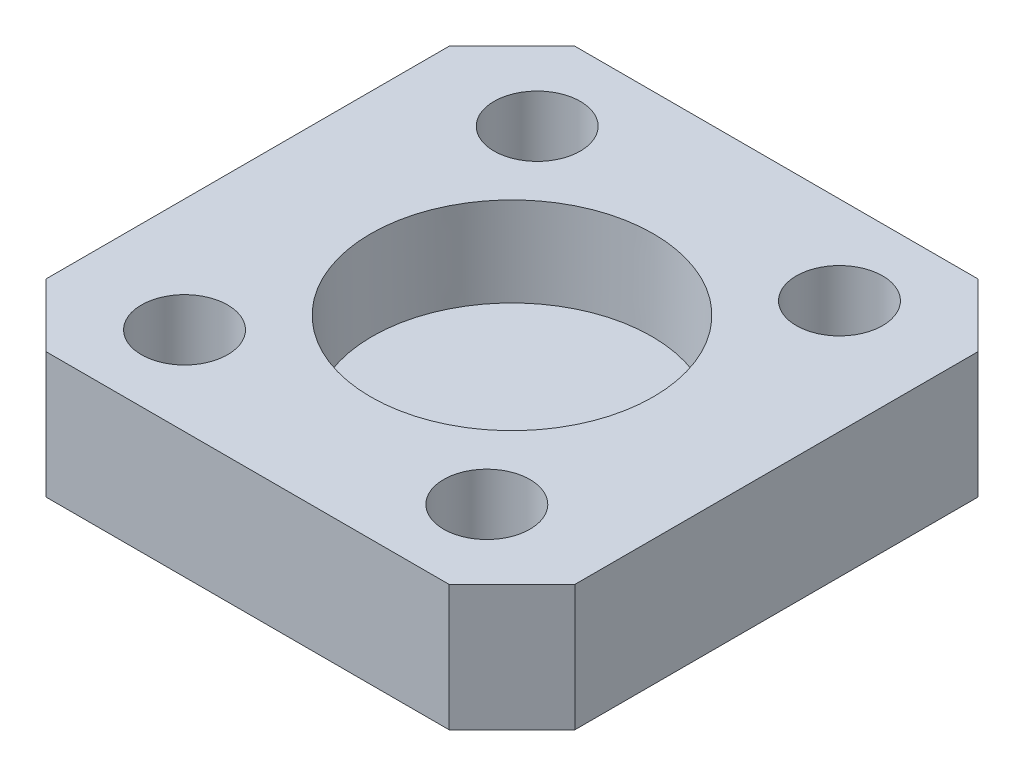
ISO-10303-21;
HEADER;
FILE_DESCRIPTION(('STEP AP214'),'2;1');
FILE_NAME('part.step','',(''),(''),'','','');
FILE_SCHEMA(('AUTOMOTIVE_DESIGN { 1 0 10303 214 1 1 1 1 }'));
ENDSEC;
DATA;
#1=APPLICATION_CONTEXT('core data for automotive mechanical design processes');
#2=APPLICATION_PROTOCOL_DEFINITION('international standard','automotive_design',2000,#1);
#3=PRODUCT_CONTEXT('',#1,'mechanical');
#4=PRODUCT('Part','Part','',(#3));
#5=PRODUCT_RELATED_PRODUCT_CATEGORY('part','',(#4));
#6=PRODUCT_DEFINITION_FORMATION('','',#4);
#7=PRODUCT_DEFINITION_CONTEXT('part definition',#1,'design');
#8=PRODUCT_DEFINITION('design','',#6,#7);
#9=PRODUCT_DEFINITION_SHAPE('','',#8);
#10=(LENGTH_UNIT() NAMED_UNIT(*) SI_UNIT(.MILLI.,.METRE.));
#11=(NAMED_UNIT(*) PLANE_ANGLE_UNIT() SI_UNIT($,.RADIAN.));
#12=(NAMED_UNIT(*) SI_UNIT($,.STERADIAN.) SOLID_ANGLE_UNIT());
#13=UNCERTAINTY_MEASURE_WITH_UNIT(LENGTH_MEASURE(1.E-05),#10,'distance_accuracy_value','');
#14=(GEOMETRIC_REPRESENTATION_CONTEXT(3) GLOBAL_UNCERTAINTY_ASSIGNED_CONTEXT((#13)) GLOBAL_UNIT_ASSIGNED_CONTEXT((#10,
#11,#12)) REPRESENTATION_CONTEXT('',''));
#15=CARTESIAN_POINT('',(0.,0.,0.));
#16=DIRECTION('',(0.,0.,1.));
#17=DIRECTION('',(1.,0.,0.));
#18=AXIS2_PLACEMENT_3D('',#15,#16,#17);
#19=CARTESIAN_POINT('',(21.,10.,21.));
#20=DIRECTION('',(-1.,0.,0.));
#21=DIRECTION('',(0.,0.,1.));
#22=AXIS2_PLACEMENT_3D('',#19,#20,#21);
#23=PLANE('',#22);
#24=DIRECTION('',(0.,0.,-1.));
#25=VECTOR('',#24,1.);
#26=CARTESIAN_POINT('',(21.,10.,21.));
#27=LINE('',#26,#25);
#28=CARTESIAN_POINT('',(21.,10.,16.));
#29=VERTEX_POINT('',#28);
#30=CARTESIAN_POINT('',(21.,10.,-16.));
#31=VERTEX_POINT('',#30);
#32=EDGE_CURVE('E129',#29,#31,#27,.T.);
#33=ORIENTED_EDGE('',*,*,#32,.F.);
#34=DIRECTION('',(0.,-1.,0.));
#35=VECTOR('',#34,1.);
#36=CARTESIAN_POINT('',(21.,10.,16.));
#37=LINE('',#36,#35);
#38=CARTESIAN_POINT('',(21.,0.,16.));
#39=VERTEX_POINT('',#38);
#40=EDGE_CURVE('E158',#29,#39,#37,.T.);
#41=ORIENTED_EDGE('',*,*,#40,.T.);
#42=DIRECTION('',(0.,0.,-1.));
#43=VECTOR('',#42,1.);
#44=CARTESIAN_POINT('',(21.,0.,21.));
#45=LINE('',#44,#43);
#46=CARTESIAN_POINT('',(21.,0.,-16.));
#47=VERTEX_POINT('',#46);
#48=EDGE_CURVE('E164',#39,#47,#45,.T.);
#49=ORIENTED_EDGE('',*,*,#48,.T.);
#50=DIRECTION('',(0.,1.,0.));
#51=VECTOR('',#50,1.);
#52=CARTESIAN_POINT('',(21.,10.,-16.));
#53=LINE('',#52,#51);
#54=EDGE_CURVE('E156',#47,#31,#53,.T.);
#55=ORIENTED_EDGE('',*,*,#54,.T.);
#56=EDGE_LOOP('',(#33,#41,#49,#55));
#57=FACE_BOUND('',#56,.T.);
#58=ADVANCED_FACE('F36',(#57),#23,.F.);
#59=CARTESIAN_POINT('',(-21.,10.,-21.));
#60=DIRECTION('',(0.,0.,1.));
#61=DIRECTION('',(1.,0.,0.));
#62=AXIS2_PLACEMENT_3D('',#59,#60,#61);
#63=PLANE('',#62);
#64=DIRECTION('',(-1.,0.,0.));
#65=VECTOR('',#64,1.);
#66=CARTESIAN_POINT('',(-21.,10.,-21.));
#67=LINE('',#66,#65);
#68=CARTESIAN_POINT('',(16.,10.,-21.));
#69=VERTEX_POINT('',#68);
#70=CARTESIAN_POINT('',(-16.,10.,-21.));
#71=VERTEX_POINT('',#70);
#72=EDGE_CURVE('E132',#69,#71,#67,.T.);
#73=ORIENTED_EDGE('',*,*,#72,.F.);
#74=DIRECTION('',(0.,-1.,0.));
#75=VECTOR('',#74,1.);
#76=CARTESIAN_POINT('',(16.,10.,-21.));
#77=LINE('',#76,#75);
#78=CARTESIAN_POINT('',(16.,0.,-21.));
#79=VERTEX_POINT('',#78);
#80=EDGE_CURVE('E11',#69,#79,#77,.T.);
#81=ORIENTED_EDGE('',*,*,#80,.T.);
#82=DIRECTION('',(-1.,0.,0.));
#83=VECTOR('',#82,1.);
#84=CARTESIAN_POINT('',(-21.,0.,-21.));
#85=LINE('',#84,#83);
#86=CARTESIAN_POINT('',(-16.,0.,-21.));
#87=VERTEX_POINT('',#86);
#88=EDGE_CURVE('E134',#79,#87,#85,.T.);
#89=ORIENTED_EDGE('',*,*,#88,.T.);
#90=DIRECTION('',(0.,1.,0.));
#91=VECTOR('',#90,1.);
#92=CARTESIAN_POINT('',(-16.,10.,-21.));
#93=LINE('',#92,#91);
#94=EDGE_CURVE('E45',#87,#71,#93,.T.);
#95=ORIENTED_EDGE('',*,*,#94,.T.);
#96=EDGE_LOOP('',(#73,#81,#89,#95));
#97=FACE_BOUND('',#96,.T.);
#98=ADVANCED_FACE('F260',(#97),#63,.F.);
#99=CARTESIAN_POINT('',(-21.,10.,21.));
#100=DIRECTION('',(1.,0.,0.));
#101=DIRECTION('',(0.,0.,-1.));
#102=AXIS2_PLACEMENT_3D('',#99,#100,#101);
#103=PLANE('',#102);
#104=DIRECTION('',(0.,0.,1.));
#105=VECTOR('',#104,1.);
#106=CARTESIAN_POINT('',(-21.,0.,21.));
#107=LINE('',#106,#105);
#108=CARTESIAN_POINT('',(-21.,0.,-16.));
#109=VERTEX_POINT('',#108);
#110=CARTESIAN_POINT('',(-21.,0.,16.));
#111=VERTEX_POINT('',#110);
#112=EDGE_CURVE('E130',#109,#111,#107,.T.);
#113=ORIENTED_EDGE('',*,*,#112,.T.);
#114=DIRECTION('',(0.,1.,0.));
#115=VECTOR('',#114,1.);
#116=CARTESIAN_POINT('',(-21.,10.,16.));
#117=LINE('',#116,#115);
#118=CARTESIAN_POINT('',(-21.,10.,16.));
#119=VERTEX_POINT('',#118);
#120=EDGE_CURVE('E108',#111,#119,#117,.T.);
#121=ORIENTED_EDGE('',*,*,#120,.T.);
#122=DIRECTION('',(0.,0.,1.));
#123=VECTOR('',#122,1.);
#124=CARTESIAN_POINT('',(-21.,10.,21.));
#125=LINE('',#124,#123);
#126=CARTESIAN_POINT('',(-21.,10.,-16.));
#127=VERTEX_POINT('',#126);
#128=EDGE_CURVE('E176',#127,#119,#125,.T.);
#129=ORIENTED_EDGE('',*,*,#128,.F.);
#130=DIRECTION('',(0.,-1.,0.));
#131=VECTOR('',#130,1.);
#132=CARTESIAN_POINT('',(-21.,10.,-16.));
#133=LINE('',#132,#131);
#134=EDGE_CURVE('E113',#127,#109,#133,.T.);
#135=ORIENTED_EDGE('',*,*,#134,.T.);
#136=EDGE_LOOP('',(#113,#121,#129,#135));
#137=FACE_BOUND('',#136,.T.);
#138=ADVANCED_FACE('F258',(#137),#103,.F.);
#139=CARTESIAN_POINT('',(-21.,10.,21.));
#140=DIRECTION('',(0.,0.,-1.));
#141=DIRECTION('',(-1.,0.,0.));
#142=AXIS2_PLACEMENT_3D('',#139,#140,#141);
#143=PLANE('',#142);
#144=DIRECTION('',(1.,0.,0.));
#145=VECTOR('',#144,1.);
#146=CARTESIAN_POINT('',(-21.,10.,21.));
#147=LINE('',#146,#145);
#148=CARTESIAN_POINT('',(-16.,10.,21.));
#149=VERTEX_POINT('',#148);
#150=CARTESIAN_POINT('',(16.,10.,21.));
#151=VERTEX_POINT('',#150);
#152=EDGE_CURVE('E123',#149,#151,#147,.T.);
#153=ORIENTED_EDGE('',*,*,#152,.F.);
#154=DIRECTION('',(0.,-1.,0.));
#155=VECTOR('',#154,1.);
#156=CARTESIAN_POINT('',(-16.,10.,21.));
#157=LINE('',#156,#155);
#158=CARTESIAN_POINT('',(-16.,0.,21.));
#159=VERTEX_POINT('',#158);
#160=EDGE_CURVE('E107',#149,#159,#157,.T.);
#161=ORIENTED_EDGE('',*,*,#160,.T.);
#162=DIRECTION('',(1.,0.,0.));
#163=VECTOR('',#162,1.);
#164=CARTESIAN_POINT('',(-21.,0.,21.));
#165=LINE('',#164,#163);
#166=CARTESIAN_POINT('',(16.,0.,21.));
#167=VERTEX_POINT('',#166);
#168=EDGE_CURVE('E120',#159,#167,#165,.T.);
#169=ORIENTED_EDGE('',*,*,#168,.T.);
#170=DIRECTION('',(0.,1.,0.));
#171=VECTOR('',#170,1.);
#172=CARTESIAN_POINT('',(16.,10.,21.));
#173=LINE('',#172,#171);
#174=EDGE_CURVE('E125',#167,#151,#173,.T.);
#175=ORIENTED_EDGE('',*,*,#174,.T.);
#176=EDGE_LOOP('',(#153,#161,#169,#175));
#177=FACE_BOUND('',#176,.T.);
#178=ADVANCED_FACE('F119',(#177),#143,.F.);
#179=CARTESIAN_POINT('',(0.,10.,0.));
#180=DIRECTION('',(0.,-1.,0.));
#181=DIRECTION('',(0.,0.,-1.));
#182=AXIS2_PLACEMENT_3D('',#179,#180,#181);
#183=PLANE('',#182);
#184=CARTESIAN_POINT('',(12.,10.,-14.));
#185=DIRECTION('',(0.,1.,0.));
#186=DIRECTION('',(0.,0.,-1.));
#187=AXIS2_PLACEMENT_3D('',#184,#185,#186);
#188=CIRCLE('',#187,3.425);
#189=CARTESIAN_POINT('',(12.,10.,-17.425));
#190=VERTEX_POINT('',#189);
#191=EDGE_CURVE('E186',#190,#190,#188,.T.);
#192=ORIENTED_EDGE('',*,*,#191,.F.);
#193=EDGE_LOOP('',(#192));
#194=FACE_BOUND('',#193,.T.);
#195=CARTESIAN_POINT('',(12.,10.,14.));
#196=DIRECTION('',(0.,1.,0.));
#197=DIRECTION('',(0.,0.,1.));
#198=AXIS2_PLACEMENT_3D('',#195,#196,#197);
#199=CIRCLE('',#198,3.42499999999999);
#200=CARTESIAN_POINT('',(12.,10.,17.425));
#201=VERTEX_POINT('',#200);
#202=EDGE_CURVE('E193',#201,#201,#199,.T.);
#203=ORIENTED_EDGE('',*,*,#202,.F.);
#204=EDGE_LOOP('',(#203));
#205=FACE_BOUND('',#204,.T.);
#206=CARTESIAN_POINT('',(-12.,10.,14.));
#207=DIRECTION('',(0.,1.,0.));
#208=DIRECTION('',(0.,0.,-1.));
#209=AXIS2_PLACEMENT_3D('',#206,#207,#208);
#210=CIRCLE('',#209,3.425);
#211=CARTESIAN_POINT('',(-12.,10.,10.575));
#212=VERTEX_POINT('',#211);
#213=EDGE_CURVE('E199',#212,#212,#210,.T.);
#214=ORIENTED_EDGE('',*,*,#213,.F.);
#215=EDGE_LOOP('',(#214));
#216=FACE_BOUND('',#215,.T.);
#217=CARTESIAN_POINT('',(-12.,10.,-14.));
#218=DIRECTION('',(0.,1.,0.));
#219=DIRECTION('',(0.,0.,1.));
#220=AXIS2_PLACEMENT_3D('',#217,#218,#219);
#221=CIRCLE('',#220,3.425);
#222=CARTESIAN_POINT('',(-12.,10.,-10.575));
#223=VERTEX_POINT('',#222);
#224=EDGE_CURVE('E180',#223,#223,#221,.T.);
#225=ORIENTED_EDGE('',*,*,#224,.F.);
#226=EDGE_LOOP('',(#225));
#227=FACE_BOUND('',#226,.T.);
#228=CARTESIAN_POINT('',(0.,10.,0.));
#229=DIRECTION('',(0.,-1.,0.));
#230=DIRECTION('',(0.,0.,-1.));
#231=AXIS2_PLACEMENT_3D('',#228,#229,#230);
#232=CIRCLE('',#231,11.2221854544974);
#233=CARTESIAN_POINT('',(0.,10.,-11.2221854544974));
#234=VERTEX_POINT('',#233);
#235=EDGE_CURVE('E138',#234,#234,#232,.T.);
#236=ORIENTED_EDGE('',*,*,#235,.T.);
#237=EDGE_LOOP('',(#236));
#238=FACE_BOUND('',#237,.T.);
#239=ORIENTED_EDGE('',*,*,#128,.T.);
#240=DIRECTION('',(-0.707106781186546,0.,-0.707106781186549));
#241=VECTOR('',#240,1.);
#242=CARTESIAN_POINT('',(-16.,10.,21.));
#243=LINE('',#242,#241);
#244=EDGE_CURVE('E154',#119,#149,#243,.F.);
#245=ORIENTED_EDGE('',*,*,#244,.T.);
#246=ORIENTED_EDGE('',*,*,#152,.T.);
#247=DIRECTION('',(-0.707106781186549,0.,0.707106781186546));
#248=VECTOR('',#247,1.);
#249=CARTESIAN_POINT('',(21.,10.,16.));
#250=LINE('',#249,#248);
#251=EDGE_CURVE('E152',#151,#29,#250,.F.);
#252=ORIENTED_EDGE('',*,*,#251,.T.);
#253=ORIENTED_EDGE('',*,*,#32,.T.);
#254=DIRECTION('',(0.707106781186546,0.,0.707106781186549));
#255=VECTOR('',#254,1.);
#256=CARTESIAN_POINT('',(16.,10.,-21.));
#257=LINE('',#256,#255);
#258=EDGE_CURVE('E58',#31,#69,#257,.F.);
#259=ORIENTED_EDGE('',*,*,#258,.T.);
#260=ORIENTED_EDGE('',*,*,#72,.T.);
#261=DIRECTION('',(0.707106781186549,0.,-0.707106781186546));
#262=VECTOR('',#261,1.);
#263=CARTESIAN_POINT('',(-21.,10.,-16.));
#264=LINE('',#263,#262);
#265=EDGE_CURVE('E149',#71,#127,#264,.F.);
#266=ORIENTED_EDGE('',*,*,#265,.T.);
#267=EDGE_LOOP('',(#239,#245,#246,#252,#253,#259,#260,#266));
#268=FACE_BOUND('',#267,.T.);
#269=ADVANCED_FACE('F243',(#194,#205,#216,#227,#238,#268),#183,.F.);
#270=CARTESIAN_POINT('',(0.,0.,0.));
#271=DIRECTION('',(0.,-1.,0.));
#272=DIRECTION('',(0.,0.,-1.));
#273=AXIS2_PLACEMENT_3D('',#270,#271,#272);
#274=PLANE('',#273);
#275=CARTESIAN_POINT('',(-12.,0.,14.));
#276=DIRECTION('',(0.,-1.,0.));
#277=DIRECTION('',(0.,0.,-1.));
#278=AXIS2_PLACEMENT_3D('',#275,#276,#277);
#279=CIRCLE('',#278,1.675);
#280=CARTESIAN_POINT('',(-12.,0.,12.325));
#281=VERTEX_POINT('',#280);
#282=EDGE_CURVE('E210',#281,#281,#279,.F.);
#283=ORIENTED_EDGE('',*,*,#282,.T.);
#284=EDGE_LOOP('',(#283));
#285=FACE_BOUND('',#284,.T.);
#286=CARTESIAN_POINT('',(12.,0.,14.));
#287=DIRECTION('',(0.,-1.,0.));
#288=DIRECTION('',(0.,0.,-1.));
#289=AXIS2_PLACEMENT_3D('',#286,#287,#288);
#290=CIRCLE('',#289,1.675);
#291=CARTESIAN_POINT('',(12.,0.,12.325));
#292=VERTEX_POINT('',#291);
#293=EDGE_CURVE('E216',#292,#292,#290,.F.);
#294=ORIENTED_EDGE('',*,*,#293,.T.);
#295=EDGE_LOOP('',(#294));
#296=FACE_BOUND('',#295,.T.);
#297=CARTESIAN_POINT('',(12.,0.,-14.));
#298=DIRECTION('',(0.,-1.,0.));
#299=DIRECTION('',(0.,0.,-1.));
#300=AXIS2_PLACEMENT_3D('',#297,#298,#299);
#301=CIRCLE('',#300,1.675);
#302=CARTESIAN_POINT('',(12.,0.,-15.675));
#303=VERTEX_POINT('',#302);
#304=EDGE_CURVE('E222',#303,#303,#301,.F.);
#305=ORIENTED_EDGE('',*,*,#304,.T.);
#306=EDGE_LOOP('',(#305));
#307=FACE_BOUND('',#306,.T.);
#308=CARTESIAN_POINT('',(-12.,0.,-14.));
#309=DIRECTION('',(0.,-1.,0.));
#310=DIRECTION('',(0.,0.,-1.));
#311=AXIS2_PLACEMENT_3D('',#308,#309,#310);
#312=CIRCLE('',#311,1.675);
#313=CARTESIAN_POINT('',(-12.,0.,-15.675));
#314=VERTEX_POINT('',#313);
#315=EDGE_CURVE('E204',#314,#314,#312,.F.);
#316=ORIENTED_EDGE('',*,*,#315,.T.);
#317=EDGE_LOOP('',(#316));
#318=FACE_BOUND('',#317,.T.);
#319=ORIENTED_EDGE('',*,*,#168,.F.);
#320=DIRECTION('',(0.707106781186546,0.,0.707106781186549));
#321=VECTOR('',#320,1.);
#322=CARTESIAN_POINT('',(-18.5,0.,18.5));
#323=LINE('',#322,#321);
#324=EDGE_CURVE('E103',#159,#111,#323,.F.);
#325=ORIENTED_EDGE('',*,*,#324,.T.);
#326=ORIENTED_EDGE('',*,*,#112,.F.);
#327=DIRECTION('',(-0.707106781186549,0.,0.707106781186546));
#328=VECTOR('',#327,1.);
#329=CARTESIAN_POINT('',(-18.5,0.,-18.5));
#330=LINE('',#329,#328);
#331=EDGE_CURVE('E124',#109,#87,#330,.F.);
#332=ORIENTED_EDGE('',*,*,#331,.T.);
#333=ORIENTED_EDGE('',*,*,#88,.F.);
#334=DIRECTION('',(-0.707106781186546,0.,-0.707106781186549));
#335=VECTOR('',#334,1.);
#336=CARTESIAN_POINT('',(18.5,0.,-18.5));
#337=LINE('',#336,#335);
#338=EDGE_CURVE('E143',#79,#47,#337,.F.);
#339=ORIENTED_EDGE('',*,*,#338,.T.);
#340=ORIENTED_EDGE('',*,*,#48,.F.);
#341=DIRECTION('',(0.707106781186549,0.,-0.707106781186546));
#342=VECTOR('',#341,1.);
#343=CARTESIAN_POINT('',(18.5,0.,18.5));
#344=LINE('',#343,#342);
#345=EDGE_CURVE('E114',#39,#167,#344,.F.);
#346=ORIENTED_EDGE('',*,*,#345,.T.);
#347=EDGE_LOOP('',(#319,#325,#326,#332,#333,#339,#340,#346));
#348=FACE_BOUND('',#347,.T.);
#349=ADVANCED_FACE('F127',(#285,#296,#307,#318,#348),#274,.T.);
#350=CARTESIAN_POINT('',(0.,3.,0.));
#351=DIRECTION('',(0.,1.,0.));
#352=DIRECTION('',(0.,0.,1.));
#353=AXIS2_PLACEMENT_3D('',#350,#351,#352);
#354=PLANE('',#353);
#355=CARTESIAN_POINT('',(0.,3.,0.));
#356=DIRECTION('',(0.,1.,0.));
#357=DIRECTION('',(0.,0.,1.));
#358=AXIS2_PLACEMENT_3D('',#355,#356,#357);
#359=CIRCLE('',#358,11.1);
#360=CARTESIAN_POINT('',(0.,3.,11.1));
#361=VERTEX_POINT('',#360);
#362=EDGE_CURVE('E169',#361,#361,#359,.T.);
#363=ORIENTED_EDGE('',*,*,#362,.T.);
#364=EDGE_LOOP('',(#363));
#365=FACE_BOUND('',#364,.T.);
#366=ADVANCED_FACE('F288',(#365),#354,.T.);
#367=CARTESIAN_POINT('',(0.,3.00000000000289,0.));
#368=DIRECTION('',(0.,1.,0.));
#369=DIRECTION('',(0.,0.,1.));
#370=AXIS2_PLACEMENT_3D('',#367,#368,#369);
#371=CONICAL_SURFACE('',#370,11.1,0.0174532925199399);
#372=ORIENTED_EDGE('',*,*,#235,.F.);
#373=EDGE_LOOP('',(#372));
#374=FACE_BOUND('',#373,.T.);
#375=ORIENTED_EDGE('',*,*,#362,.F.);
#376=EDGE_LOOP('',(#375));
#377=FACE_BOUND('',#376,.T.);
#378=ADVANCED_FACE('F282',(#374,#377),#371,.F.);
#379=CARTESIAN_POINT('',(-12.,2.,-14.));
#380=DIRECTION('',(0.,1.,0.));
#381=DIRECTION('',(0.,0.,1.));
#382=AXIS2_PLACEMENT_3D('',#379,#380,#381);
#383=CYLINDRICAL_SURFACE('',#382,3.425);
#384=CARTESIAN_POINT('',(-12.,2.,-14.));
#385=DIRECTION('',(0.,1.,0.));
#386=DIRECTION('',(0.,0.,1.));
#387=AXIS2_PLACEMENT_3D('',#384,#385,#386);
#388=CIRCLE('',#387,3.425);
#389=CARTESIAN_POINT('',(-12.,2.,-10.575));
#390=VERTEX_POINT('',#389);
#391=EDGE_CURVE('E172',#390,#390,#388,.T.);
#392=ORIENTED_EDGE('',*,*,#391,.F.);
#393=EDGE_LOOP('',(#392));
#394=FACE_BOUND('',#393,.T.);
#395=ORIENTED_EDGE('',*,*,#224,.T.);
#396=EDGE_LOOP('',(#395));
#397=FACE_BOUND('',#396,.T.);
#398=ADVANCED_FACE('F287',(#394,#397),#383,.F.);
#399=CARTESIAN_POINT('',(-12.,2.,-14.));
#400=DIRECTION('',(0.,1.,0.));
#401=DIRECTION('',(0.,0.,1.));
#402=AXIS2_PLACEMENT_3D('',#399,#400,#401);
#403=PLANE('',#402);
#404=CARTESIAN_POINT('',(-12.,2.,-14.));
#405=DIRECTION('',(0.,1.,0.));
#406=DIRECTION('',(0.,0.,1.));
#407=AXIS2_PLACEMENT_3D('',#404,#405,#406);
#408=CIRCLE('',#407,1.675);
#409=CARTESIAN_POINT('',(-12.,2.,-12.325));
#410=VERTEX_POINT('',#409);
#411=EDGE_CURVE('E190',#410,#410,#408,.T.);
#412=ORIENTED_EDGE('',*,*,#411,.F.);
#413=EDGE_LOOP('',(#412));
#414=FACE_BOUND('',#413,.T.);
#415=ORIENTED_EDGE('',*,*,#391,.T.);
#416=EDGE_LOOP('',(#415));
#417=FACE_BOUND('',#416,.T.);
#418=ADVANCED_FACE('F303',(#414,#417),#403,.T.);
#419=CARTESIAN_POINT('',(-12.,2.,14.));
#420=DIRECTION('',(0.,1.,0.));
#421=DIRECTION('',(0.,0.,1.));
#422=AXIS2_PLACEMENT_3D('',#419,#420,#421);
#423=CYLINDRICAL_SURFACE('',#422,3.425);
#424=CARTESIAN_POINT('',(-12.,2.,14.));
#425=DIRECTION('',(0.,1.,0.));
#426=DIRECTION('',(0.,0.,-1.));
#427=AXIS2_PLACEMENT_3D('',#424,#425,#426);
#428=CIRCLE('',#427,3.425);
#429=CARTESIAN_POINT('',(-12.,2.,10.575));
#430=VERTEX_POINT('',#429);
#431=EDGE_CURVE('E183',#430,#430,#428,.T.);
#432=ORIENTED_EDGE('',*,*,#431,.F.);
#433=EDGE_LOOP('',(#432));
#434=FACE_BOUND('',#433,.T.);
#435=ORIENTED_EDGE('',*,*,#213,.T.);
#436=EDGE_LOOP('',(#435));
#437=FACE_BOUND('',#436,.T.);
#438=ADVANCED_FACE('F351',(#434,#437),#423,.F.);
#439=CARTESIAN_POINT('',(-12.,2.,14.));
#440=DIRECTION('',(0.,-1.,0.));
#441=DIRECTION('',(0.,0.,-1.));
#442=AXIS2_PLACEMENT_3D('',#439,#440,#441);
#443=PLANE('',#442);
#444=CARTESIAN_POINT('',(-12.,2.,14.));
#445=DIRECTION('',(0.,1.,0.));
#446=DIRECTION('',(0.,0.,-1.));
#447=AXIS2_PLACEMENT_3D('',#444,#445,#446);
#448=CIRCLE('',#447,1.675);
#449=CARTESIAN_POINT('',(-12.,2.,12.325));
#450=VERTEX_POINT('',#449);
#451=EDGE_CURVE('E213',#450,#450,#448,.T.);
#452=ORIENTED_EDGE('',*,*,#451,.F.);
#453=EDGE_LOOP('',(#452));
#454=FACE_BOUND('',#453,.T.);
#455=ORIENTED_EDGE('',*,*,#431,.T.);
#456=EDGE_LOOP('',(#455));
#457=FACE_BOUND('',#456,.T.);
#458=ADVANCED_FACE('F359',(#454,#457),#443,.F.);
#459=CARTESIAN_POINT('',(12.,2.,14.));
#460=DIRECTION('',(0.,1.,0.));
#461=DIRECTION('',(0.,0.,1.));
#462=AXIS2_PLACEMENT_3D('',#459,#460,#461);
#463=CYLINDRICAL_SURFACE('',#462,3.42499999999999);
#464=CARTESIAN_POINT('',(12.,2.,14.));
#465=DIRECTION('',(0.,1.,0.));
#466=DIRECTION('',(0.,0.,1.));
#467=AXIS2_PLACEMENT_3D('',#464,#465,#466);
#468=CIRCLE('',#467,3.42499999999999);
#469=CARTESIAN_POINT('',(12.,2.,17.425));
#470=VERTEX_POINT('',#469);
#471=EDGE_CURVE('E196',#470,#470,#468,.T.);
#472=ORIENTED_EDGE('',*,*,#471,.F.);
#473=EDGE_LOOP('',(#472));
#474=FACE_BOUND('',#473,.T.);
#475=ORIENTED_EDGE('',*,*,#202,.T.);
#476=EDGE_LOOP('',(#475));
#477=FACE_BOUND('',#476,.T.);
#478=ADVANCED_FACE('F364',(#474,#477),#463,.F.);
#479=CARTESIAN_POINT('',(12.,2.,14.));
#480=DIRECTION('',(0.,1.,0.));
#481=DIRECTION('',(0.,0.,1.));
#482=AXIS2_PLACEMENT_3D('',#479,#480,#481);
#483=PLANE('',#482);
#484=CARTESIAN_POINT('',(12.,2.,14.));
#485=DIRECTION('',(0.,1.,0.));
#486=DIRECTION('',(0.,0.,1.));
#487=AXIS2_PLACEMENT_3D('',#484,#485,#486);
#488=CIRCLE('',#487,1.675);
#489=CARTESIAN_POINT('',(12.,2.,15.675));
#490=VERTEX_POINT('',#489);
#491=EDGE_CURVE('E219',#490,#490,#488,.T.);
#492=ORIENTED_EDGE('',*,*,#491,.F.);
#493=EDGE_LOOP('',(#492));
#494=FACE_BOUND('',#493,.T.);
#495=ORIENTED_EDGE('',*,*,#471,.T.);
#496=EDGE_LOOP('',(#495));
#497=FACE_BOUND('',#496,.T.);
#498=ADVANCED_FACE('F239',(#494,#497),#483,.T.);
#499=CARTESIAN_POINT('',(12.,2.,-14.));
#500=DIRECTION('',(0.,1.,0.));
#501=DIRECTION('',(0.,0.,1.));
#502=AXIS2_PLACEMENT_3D('',#499,#500,#501);
#503=CYLINDRICAL_SURFACE('',#502,3.425);
#504=CARTESIAN_POINT('',(12.,2.,-14.));
#505=DIRECTION('',(0.,1.,0.));
#506=DIRECTION('',(0.,0.,-1.));
#507=AXIS2_PLACEMENT_3D('',#504,#505,#506);
#508=CIRCLE('',#507,3.425);
#509=CARTESIAN_POINT('',(12.,2.,-17.425));
#510=VERTEX_POINT('',#509);
#511=EDGE_CURVE('E189',#510,#510,#508,.T.);
#512=ORIENTED_EDGE('',*,*,#511,.F.);
#513=EDGE_LOOP('',(#512));
#514=FACE_BOUND('',#513,.T.);
#515=ORIENTED_EDGE('',*,*,#191,.T.);
#516=EDGE_LOOP('',(#515));
#517=FACE_BOUND('',#516,.T.);
#518=ADVANCED_FACE('F233',(#514,#517),#503,.F.);
#519=CARTESIAN_POINT('',(12.,2.,-14.));
#520=DIRECTION('',(0.,-1.,0.));
#521=DIRECTION('',(0.,0.,-1.));
#522=AXIS2_PLACEMENT_3D('',#519,#520,#521);
#523=PLANE('',#522);
#524=CARTESIAN_POINT('',(12.,2.,-14.));
#525=DIRECTION('',(0.,1.,0.));
#526=DIRECTION('',(0.,0.,-1.));
#527=AXIS2_PLACEMENT_3D('',#524,#525,#526);
#528=CIRCLE('',#527,1.675);
#529=CARTESIAN_POINT('',(12.,2.,-15.675));
#530=VERTEX_POINT('',#529);
#531=EDGE_CURVE('E207',#530,#530,#528,.T.);
#532=ORIENTED_EDGE('',*,*,#531,.F.);
#533=EDGE_LOOP('',(#532));
#534=FACE_BOUND('',#533,.T.);
#535=ORIENTED_EDGE('',*,*,#511,.T.);
#536=EDGE_LOOP('',(#535));
#537=FACE_BOUND('',#536,.T.);
#538=ADVANCED_FACE('F230',(#534,#537),#523,.F.);
#539=CARTESIAN_POINT('',(-16.,10.,21.));
#540=DIRECTION('',(0.707106781186549,0.,-0.707106781186546));
#541=DIRECTION('',(0.,-1.,0.));
#542=AXIS2_PLACEMENT_3D('',#539,#540,#541);
#543=PLANE('',#542);
#544=ORIENTED_EDGE('',*,*,#244,.F.);
#545=ORIENTED_EDGE('',*,*,#120,.F.);
#546=ORIENTED_EDGE('',*,*,#324,.F.);
#547=ORIENTED_EDGE('',*,*,#160,.F.);
#548=EDGE_LOOP('',(#544,#545,#546,#547));
#549=FACE_BOUND('',#548,.T.);
#550=ADVANCED_FACE('F106',(#549),#543,.F.);
#551=CARTESIAN_POINT('',(21.,10.,16.));
#552=DIRECTION('',(-0.707106781186546,0.,-0.707106781186549));
#553=DIRECTION('',(0.,-1.,0.));
#554=AXIS2_PLACEMENT_3D('',#551,#552,#553);
#555=PLANE('',#554);
#556=ORIENTED_EDGE('',*,*,#251,.F.);
#557=ORIENTED_EDGE('',*,*,#174,.F.);
#558=ORIENTED_EDGE('',*,*,#345,.F.);
#559=ORIENTED_EDGE('',*,*,#40,.F.);
#560=EDGE_LOOP('',(#556,#557,#558,#559));
#561=FACE_BOUND('',#560,.T.);
#562=ADVANCED_FACE('F264',(#561),#555,.F.);
#563=CARTESIAN_POINT('',(16.,10.,-21.));
#564=DIRECTION('',(-0.707106781186549,0.,0.707106781186546));
#565=DIRECTION('',(0.,-1.,0.));
#566=AXIS2_PLACEMENT_3D('',#563,#564,#565);
#567=PLANE('',#566);
#568=ORIENTED_EDGE('',*,*,#258,.F.);
#569=ORIENTED_EDGE('',*,*,#54,.F.);
#570=ORIENTED_EDGE('',*,*,#338,.F.);
#571=ORIENTED_EDGE('',*,*,#80,.F.);
#572=EDGE_LOOP('',(#568,#569,#570,#571));
#573=FACE_BOUND('',#572,.T.);
#574=ADVANCED_FACE('F263',(#573),#567,.F.);
#575=CARTESIAN_POINT('',(-21.,10.,-16.));
#576=DIRECTION('',(0.707106781186546,0.,0.707106781186549));
#577=DIRECTION('',(0.,-1.,0.));
#578=AXIS2_PLACEMENT_3D('',#575,#576,#577);
#579=PLANE('',#578);
#580=ORIENTED_EDGE('',*,*,#265,.F.);
#581=ORIENTED_EDGE('',*,*,#94,.F.);
#582=ORIENTED_EDGE('',*,*,#331,.F.);
#583=ORIENTED_EDGE('',*,*,#134,.F.);
#584=EDGE_LOOP('',(#580,#581,#582,#583));
#585=FACE_BOUND('',#584,.T.);
#586=ADVANCED_FACE('F39',(#585),#579,.F.);
#587=CARTESIAN_POINT('',(-12.,-0.00100000000000013,-14.));
#588=DIRECTION('',(0.,1.,0.));
#589=DIRECTION('',(0.,0.,1.));
#590=AXIS2_PLACEMENT_3D('',#587,#588,#589);
#591=CYLINDRICAL_SURFACE('',#590,1.675);
#592=ORIENTED_EDGE('',*,*,#315,.F.);
#593=EDGE_LOOP('',(#592));
#594=FACE_BOUND('',#593,.T.);
#595=ORIENTED_EDGE('',*,*,#411,.T.);
#596=EDGE_LOOP('',(#595));
#597=FACE_BOUND('',#596,.T.);
#598=ADVANCED_FACE('F389',(#594,#597),#591,.F.);
#599=CARTESIAN_POINT('',(12.,-0.00100000000000013,-14.));
#600=DIRECTION('',(0.,1.,0.));
#601=DIRECTION('',(0.,0.,1.));
#602=AXIS2_PLACEMENT_3D('',#599,#600,#601);
#603=CYLINDRICAL_SURFACE('',#602,1.675);
#604=ORIENTED_EDGE('',*,*,#304,.F.);
#605=EDGE_LOOP('',(#604));
#606=FACE_BOUND('',#605,.T.);
#607=ORIENTED_EDGE('',*,*,#531,.T.);
#608=EDGE_LOOP('',(#607));
#609=FACE_BOUND('',#608,.T.);
#610=ADVANCED_FACE('F228',(#606,#609),#603,.F.);
#611=CARTESIAN_POINT('',(12.,-0.00100000000000013,14.));
#612=DIRECTION('',(0.,1.,0.));
#613=DIRECTION('',(0.,0.,1.));
#614=AXIS2_PLACEMENT_3D('',#611,#612,#613);
#615=CYLINDRICAL_SURFACE('',#614,1.675);
#616=ORIENTED_EDGE('',*,*,#293,.F.);
#617=EDGE_LOOP('',(#616));
#618=FACE_BOUND('',#617,.T.);
#619=ORIENTED_EDGE('',*,*,#491,.T.);
#620=EDGE_LOOP('',(#619));
#621=FACE_BOUND('',#620,.T.);
#622=ADVANCED_FACE('F403',(#618,#621),#615,.F.);
#623=CARTESIAN_POINT('',(-12.,-0.00100000000000013,14.));
#624=DIRECTION('',(0.,1.,0.));
#625=DIRECTION('',(0.,0.,1.));
#626=AXIS2_PLACEMENT_3D('',#623,#624,#625);
#627=CYLINDRICAL_SURFACE('',#626,1.675);
#628=ORIENTED_EDGE('',*,*,#282,.F.);
#629=EDGE_LOOP('',(#628));
#630=FACE_BOUND('',#629,.T.);
#631=ORIENTED_EDGE('',*,*,#451,.T.);
#632=EDGE_LOOP('',(#631));
#633=FACE_BOUND('',#632,.T.);
#634=ADVANCED_FACE('F413',(#630,#633),#627,.F.);
#635=CLOSED_SHELL('',(#58,#98,#138,#178,#269,#349,#366,#378,#398,#418,#438,#458,#478,#498,#518,
#538,#550,#562,#574,#586,#598,#610,#622,#634));
#636=MANIFOLD_SOLID_BREP('B2',#635);
#637=ADVANCED_BREP_SHAPE_REPRESENTATION('',(#18,#636),#14);
#638=SHAPE_DEFINITION_REPRESENTATION(#9,#637);
ENDSEC;
END-ISO-10303-21;
